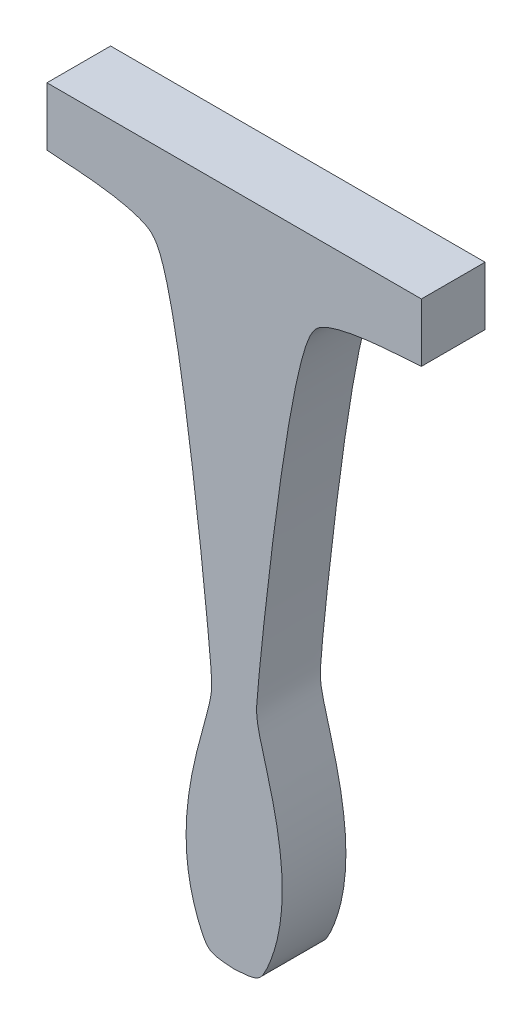
ISO-10303-21;
HEADER;
FILE_DESCRIPTION(('STEP AP214'),'2;1');
FILE_NAME('part.step','',(''),(''),'','','');
FILE_SCHEMA(('AUTOMOTIVE_DESIGN { 1 0 10303 214 1 1 1 1 }'));
ENDSEC;
DATA;
#1=APPLICATION_CONTEXT('core data for automotive mechanical design processes');
#2=APPLICATION_PROTOCOL_DEFINITION('international standard','automotive_design',2000,#1);
#3=PRODUCT_CONTEXT('',#1,'mechanical');
#4=PRODUCT('Part','Part','',(#3));
#5=PRODUCT_RELATED_PRODUCT_CATEGORY('part','',(#4));
#6=PRODUCT_DEFINITION_FORMATION('','',#4);
#7=PRODUCT_DEFINITION_CONTEXT('part definition',#1,'design');
#8=PRODUCT_DEFINITION('design','',#6,#7);
#9=PRODUCT_DEFINITION_SHAPE('','',#8);
#10=(LENGTH_UNIT() NAMED_UNIT(*) SI_UNIT(.MILLI.,.METRE.));
#11=(NAMED_UNIT(*) PLANE_ANGLE_UNIT() SI_UNIT($,.RADIAN.));
#12=(NAMED_UNIT(*) SI_UNIT($,.STERADIAN.) SOLID_ANGLE_UNIT());
#13=UNCERTAINTY_MEASURE_WITH_UNIT(LENGTH_MEASURE(1.E-05),#10,'distance_accuracy_value','');
#14=(GEOMETRIC_REPRESENTATION_CONTEXT(3) GLOBAL_UNCERTAINTY_ASSIGNED_CONTEXT((#13)) GLOBAL_UNIT_ASSIGNED_CONTEXT((#10,
#11,#12)) REPRESENTATION_CONTEXT('',''));
#15=CARTESIAN_POINT('',(0.,0.,0.));
#16=DIRECTION('',(0.,0.,1.));
#17=DIRECTION('',(1.,0.,0.));
#18=AXIS2_PLACEMENT_3D('',#15,#16,#17);
#19=CARTESIAN_POINT('',(-25.,24.6224698489385,8.5));
#20=DIRECTION('',(1.,0.,0.));
#21=DIRECTION('',(0.,0.,-1.));
#22=AXIS2_PLACEMENT_3D('',#19,#20,#21);
#23=PLANE('',#22);
#24=DIRECTION('',(0.,-1.,0.));
#25=VECTOR('',#24,1.);
#26=CARTESIAN_POINT('',(-25.,24.6224698489385,0.));
#27=LINE('',#26,#25);
#28=CARTESIAN_POINT('',(-25.,24.6224698489385,0.));
#29=VERTEX_POINT('',#28);
#30=CARTESIAN_POINT('',(-25.,16.8224698489385,0.));
#31=VERTEX_POINT('',#30);
#32=EDGE_CURVE('E110',#29,#31,#27,.T.);
#33=ORIENTED_EDGE('',*,*,#32,.T.);
#34=DIRECTION('',(0.,0.,-1.));
#35=VECTOR('',#34,1.);
#36=CARTESIAN_POINT('',(-25.,16.8224698489385,8.5));
#37=LINE('',#36,#35);
#38=CARTESIAN_POINT('',(-25.,16.8224698489385,8.5));
#39=VERTEX_POINT('',#38);
#40=EDGE_CURVE('E11',#39,#31,#37,.T.);
#41=ORIENTED_EDGE('',*,*,#40,.F.);
#42=DIRECTION('',(0.,-1.,0.));
#43=VECTOR('',#42,1.);
#44=CARTESIAN_POINT('',(-25.,24.6224698489385,8.5));
#45=LINE('',#44,#43);
#46=CARTESIAN_POINT('',(-25.,24.6224698489385,8.5));
#47=VERTEX_POINT('',#46);
#48=EDGE_CURVE('E128',#47,#39,#45,.T.);
#49=ORIENTED_EDGE('',*,*,#48,.F.);
#50=DIRECTION('',(0.,0.,-1.));
#51=VECTOR('',#50,1.);
#52=CARTESIAN_POINT('',(-25.,24.6224698489385,8.5));
#53=LINE('',#52,#51);
#54=EDGE_CURVE('E103',#47,#29,#53,.T.);
#55=ORIENTED_EDGE('',*,*,#54,.T.);
#56=EDGE_LOOP('',(#33,#41,#49,#55));
#57=FACE_BOUND('',#56,.T.);
#58=ADVANCED_FACE('F33',(#57),#23,.F.);
#59=CARTESIAN_POINT('',(-25.,16.8224698489385,8.5));
#60=CARTESIAN_POINT('',(-22.6739756728944,16.579509698242,8.5));
#61=CARTESIAN_POINT('',(-13.8510418999966,16.4558181555644,8.5));
#62=CARTESIAN_POINT('',(-7.70000242879898,11.8759382786709,8.5));
#63=CARTESIAN_POINT('',(-3.13073732441337,-30.2470599881505,8.5));
#64=CARTESIAN_POINT('',(-2.79278991771212,-37.2371371006395,8.5));
#65=CARTESIAN_POINT('',(-8.92495518330859,-51.751667059215,8.5));
#66=CARTESIAN_POINT('',(-3.69984683591176,-65.0160372604013,8.5));
#67=CARTESIAN_POINT('',(-2.69878839542446,-65.1930219159887,8.5));
#68=CARTESIAN_POINT('',(3.46178825067615E-13,-65.3775301510615,8.5));
#69=B_SPLINE_CURVE_WITH_KNOTS('',3,(#59,#60,#61,#62,#63,#64,#65,#66,#67,#68),.UNSPECIFIED.,.F.,
.F.,(4,1,1,1,1,1,1,4),(0.,0.256782561953803,0.320281149750976,0.600018685947199,
0.665715782221935,0.911555016223594,0.948056428426421,1.),.UNSPECIFIED.);
#70=DIRECTION('',(0.,0.,-1.));
#71=VECTOR('',#70,1.);
#72=SURFACE_OF_LINEAR_EXTRUSION('',#69,#71);
#73=CARTESIAN_POINT('',(-25.,16.8224698489385,0.));
#74=CARTESIAN_POINT('',(-22.6739756728944,16.579509698242,0.));
#75=CARTESIAN_POINT('',(-13.8510418999966,16.4558181555644,0.));
#76=CARTESIAN_POINT('',(-7.70000242879898,11.8759382786709,0.));
#77=CARTESIAN_POINT('',(-3.13073732441337,-30.2470599881505,0.));
#78=CARTESIAN_POINT('',(-2.79278991771212,-37.2371371006395,0.));
#79=CARTESIAN_POINT('',(-8.92495518330859,-51.751667059215,0.));
#80=CARTESIAN_POINT('',(-3.69984683591176,-65.0160372604013,0.));
#81=CARTESIAN_POINT('',(-2.69878839542446,-65.1930219159887,0.));
#82=CARTESIAN_POINT('',(3.46178825067615E-13,-65.3775301510615,0.));
#83=B_SPLINE_CURVE_WITH_KNOTS('',3,(#73,#74,#75,#76,#77,#78,#79,#80,#81,#82),.UNSPECIFIED.,.F.,
.F.,(4,1,1,1,1,1,1,4),(0.,0.256782561953803,0.320281149750976,0.600018685947199,
0.665715782221935,0.911555016223594,0.948056428426421,1.),.UNSPECIFIED.);
#84=CARTESIAN_POINT('',(-3.46178825067615E-13,-65.3775301510615,0.));
#85=VERTEX_POINT('',#84);
#86=EDGE_CURVE('E113',#31,#85,#83,.T.);
#87=ORIENTED_EDGE('',*,*,#86,.T.);
#88=DIRECTION('',(0.,0.,-1.));
#89=VECTOR('',#88,1.);
#90=CARTESIAN_POINT('',(-3.46178825067615E-13,-65.3775301510615,8.5));
#91=LINE('',#90,#89);
#92=CARTESIAN_POINT('',(-3.46178825067615E-13,-65.3775301510615,8.5));
#93=VERTEX_POINT('',#92);
#94=EDGE_CURVE('E41',#93,#85,#91,.T.);
#95=ORIENTED_EDGE('',*,*,#94,.F.);
#96=EDGE_CURVE('E83',#39,#93,#69,.T.);
#97=ORIENTED_EDGE('',*,*,#96,.F.);
#98=ORIENTED_EDGE('',*,*,#40,.T.);
#99=EDGE_LOOP('',(#87,#95,#97,#98));
#100=FACE_BOUND('',#99,.T.);
#101=ADVANCED_FACE('F147',(#100),#72,.F.);
#102=CARTESIAN_POINT('',(-3.46178825067615E-13,-65.3775301510615,8.5));
#103=CARTESIAN_POINT('',(2.69878839542446,-65.1930219159887,8.5));
#104=CARTESIAN_POINT('',(3.69984683591176,-65.0160372604013,8.5));
#105=CARTESIAN_POINT('',(8.92495518330859,-51.751667059215,8.5));
#106=CARTESIAN_POINT('',(2.79278991771212,-37.2371371006395,8.5));
#107=CARTESIAN_POINT('',(3.13073732441337,-30.2470599881505,8.5));
#108=CARTESIAN_POINT('',(7.70000242879898,11.8759382786709,8.5));
#109=CARTESIAN_POINT('',(13.8510418999966,16.4558181555644,8.5));
#110=CARTESIAN_POINT('',(22.6739756728944,16.579509698242,8.5));
#111=CARTESIAN_POINT('',(25.,16.8224698489385,8.5));
#112=B_SPLINE_CURVE_WITH_KNOTS('',3,(#102,#103,#104,#105,#106,#107,#108,#109,#110,#111),
.UNSPECIFIED.,.F.,.F.,(4,1,1,1,1,1,1,4),(0.,0.0519435715735785,0.0884449837764056,
0.334284217778065,0.399981314052801,0.679718850249024,0.743217438046197,1.),.UNSPECIFIED.);
#113=DIRECTION('',(0.,0.,-1.));
#114=VECTOR('',#113,1.);
#115=SURFACE_OF_LINEAR_EXTRUSION('',#112,#114);
#116=CARTESIAN_POINT('',(-3.46178825067615E-13,-65.3775301510615,0.));
#117=CARTESIAN_POINT('',(2.69878839542446,-65.1930219159887,0.));
#118=CARTESIAN_POINT('',(3.69984683591176,-65.0160372604013,0.));
#119=CARTESIAN_POINT('',(8.92495518330859,-51.751667059215,0.));
#120=CARTESIAN_POINT('',(2.79278991771212,-37.2371371006395,0.));
#121=CARTESIAN_POINT('',(3.13073732441337,-30.2470599881505,0.));
#122=CARTESIAN_POINT('',(7.70000242879898,11.8759382786709,0.));
#123=CARTESIAN_POINT('',(13.8510418999966,16.4558181555644,0.));
#124=CARTESIAN_POINT('',(22.6739756728944,16.579509698242,0.));
#125=CARTESIAN_POINT('',(25.,16.8224698489385,0.));
#126=B_SPLINE_CURVE_WITH_KNOTS('',3,(#116,#117,#118,#119,#120,#121,#122,#123,#124,#125),
.UNSPECIFIED.,.F.,.F.,(4,1,1,1,1,1,1,4),(0.,0.0519435715735785,0.0884449837764056,
0.334284217778065,0.399981314052801,0.679718850249024,0.743217438046197,1.),.UNSPECIFIED.);
#127=CARTESIAN_POINT('',(25.,16.8224698489385,0.));
#128=VERTEX_POINT('',#127);
#129=EDGE_CURVE('E98',#85,#128,#126,.T.);
#130=ORIENTED_EDGE('',*,*,#129,.T.);
#131=DIRECTION('',(0.,0.,-1.));
#132=VECTOR('',#131,1.);
#133=CARTESIAN_POINT('',(25.,16.8224698489385,8.5));
#134=LINE('',#133,#132);
#135=CARTESIAN_POINT('',(25.,16.8224698489385,8.5));
#136=VERTEX_POINT('',#135);
#137=EDGE_CURVE('E95',#136,#128,#134,.T.);
#138=ORIENTED_EDGE('',*,*,#137,.F.);
#139=EDGE_CURVE('E87',#93,#136,#112,.T.);
#140=ORIENTED_EDGE('',*,*,#139,.F.);
#141=ORIENTED_EDGE('',*,*,#94,.T.);
#142=EDGE_LOOP('',(#130,#138,#140,#141));
#143=FACE_BOUND('',#142,.T.);
#144=ADVANCED_FACE('F96',(#143),#115,.F.);
#145=CARTESIAN_POINT('',(25.,24.6224698489385,8.5));
#146=DIRECTION('',(-1.,0.,0.));
#147=DIRECTION('',(0.,0.,1.));
#148=AXIS2_PLACEMENT_3D('',#145,#146,#147);
#149=PLANE('',#148);
#150=DIRECTION('',(0.,1.,0.));
#151=VECTOR('',#150,1.);
#152=CARTESIAN_POINT('',(25.,24.6224698489385,0.));
#153=LINE('',#152,#151);
#154=CARTESIAN_POINT('',(25.,24.6224698489385,0.));
#155=VERTEX_POINT('',#154);
#156=EDGE_CURVE('E69',#128,#155,#153,.T.);
#157=ORIENTED_EDGE('',*,*,#156,.T.);
#158=DIRECTION('',(0.,0.,-1.));
#159=VECTOR('',#158,1.);
#160=CARTESIAN_POINT('',(25.,24.6224698489385,8.5));
#161=LINE('',#160,#159);
#162=CARTESIAN_POINT('',(25.,24.6224698489385,8.5));
#163=VERTEX_POINT('',#162);
#164=EDGE_CURVE('E99',#163,#155,#161,.T.);
#165=ORIENTED_EDGE('',*,*,#164,.F.);
#166=DIRECTION('',(0.,1.,0.));
#167=VECTOR('',#166,1.);
#168=CARTESIAN_POINT('',(25.,24.6224698489385,8.5));
#169=LINE('',#168,#167);
#170=EDGE_CURVE('E91',#136,#163,#169,.T.);
#171=ORIENTED_EDGE('',*,*,#170,.F.);
#172=ORIENTED_EDGE('',*,*,#137,.T.);
#173=EDGE_LOOP('',(#157,#165,#171,#172));
#174=FACE_BOUND('',#173,.T.);
#175=ADVANCED_FACE('F101',(#174),#149,.F.);
#176=CARTESIAN_POINT('',(25.,24.6224698489385,8.5));
#177=DIRECTION('',(0.,-1.,0.));
#178=DIRECTION('',(0.,0.,-1.));
#179=AXIS2_PLACEMENT_3D('',#176,#177,#178);
#180=PLANE('',#179);
#181=DIRECTION('',(-1.,0.,0.));
#182=VECTOR('',#181,1.);
#183=CARTESIAN_POINT('',(25.,24.6224698489385,0.));
#184=LINE('',#183,#182);
#185=EDGE_CURVE('E75',#155,#29,#184,.T.);
#186=ORIENTED_EDGE('',*,*,#185,.T.);
#187=ORIENTED_EDGE('',*,*,#54,.F.);
#188=DIRECTION('',(-1.,0.,0.));
#189=VECTOR('',#188,1.);
#190=CARTESIAN_POINT('',(25.,24.6224698489385,8.5));
#191=LINE('',#190,#189);
#192=EDGE_CURVE('E49',#163,#47,#191,.T.);
#193=ORIENTED_EDGE('',*,*,#192,.F.);
#194=ORIENTED_EDGE('',*,*,#164,.T.);
#195=EDGE_LOOP('',(#186,#187,#193,#194));
#196=FACE_BOUND('',#195,.T.);
#197=ADVANCED_FACE('F136',(#196),#180,.F.);
#198=CARTESIAN_POINT('',(-4.7191088735089,-16.9031530295289,8.5));
#199=DIRECTION('',(0.,0.,-1.));
#200=DIRECTION('',(-1.,0.,0.));
#201=AXIS2_PLACEMENT_3D('',#198,#199,#200);
#202=PLANE('',#201);
#203=ORIENTED_EDGE('',*,*,#48,.T.);
#204=ORIENTED_EDGE('',*,*,#96,.T.);
#205=ORIENTED_EDGE('',*,*,#139,.T.);
#206=ORIENTED_EDGE('',*,*,#170,.T.);
#207=ORIENTED_EDGE('',*,*,#192,.T.);
#208=EDGE_LOOP('',(#203,#204,#205,#206,#207));
#209=FACE_BOUND('',#208,.T.);
#210=ADVANCED_FACE('F89',(#209),#202,.F.);
#211=CARTESIAN_POINT('',(-4.7191088735089,-16.9031530295289,0.));
#212=DIRECTION('',(0.,0.,-1.));
#213=DIRECTION('',(-1.,0.,0.));
#214=AXIS2_PLACEMENT_3D('',#211,#212,#213);
#215=PLANE('',#214);
#216=ORIENTED_EDGE('',*,*,#32,.F.);
#217=ORIENTED_EDGE('',*,*,#185,.F.);
#218=ORIENTED_EDGE('',*,*,#156,.F.);
#219=ORIENTED_EDGE('',*,*,#129,.F.);
#220=ORIENTED_EDGE('',*,*,#86,.F.);
#221=EDGE_LOOP('',(#216,#217,#218,#219,#220));
#222=FACE_BOUND('',#221,.T.);
#223=ADVANCED_FACE('F132',(#222),#215,.T.);
#224=CLOSED_SHELL('',(#58,#101,#144,#175,#197,#210,#223));
#225=MANIFOLD_SOLID_BREP('B2',#224);
#226=ADVANCED_BREP_SHAPE_REPRESENTATION('',(#18,#225),#14);
#227=SHAPE_DEFINITION_REPRESENTATION(#9,#226);
ENDSEC;
END-ISO-10303-21;
